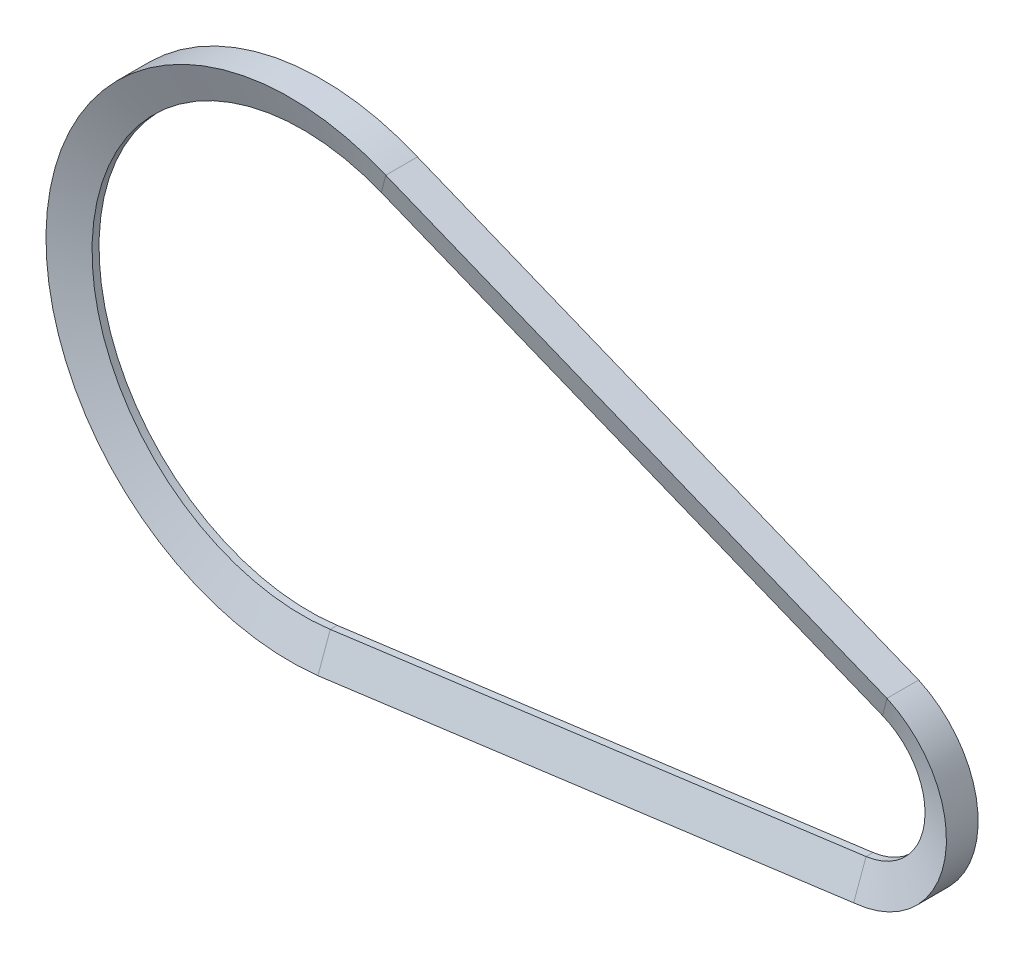
ISO-10303-21;
HEADER;
FILE_DESCRIPTION(('STEP AP214'),'2;1');
FILE_NAME('part.step','',(''),(''),'','','');
FILE_SCHEMA(('AUTOMOTIVE_DESIGN { 1 0 10303 214 1 1 1 1 }'));
ENDSEC;
DATA;
#1=APPLICATION_CONTEXT('core data for automotive mechanical design processes');
#2=APPLICATION_PROTOCOL_DEFINITION('international standard','automotive_design',2000,#1);
#3=PRODUCT_CONTEXT('',#1,'mechanical');
#4=PRODUCT('Part','Part','',(#3));
#5=PRODUCT_RELATED_PRODUCT_CATEGORY('part','',(#4));
#6=PRODUCT_DEFINITION_FORMATION('','',#4);
#7=PRODUCT_DEFINITION_CONTEXT('part definition',#1,'design');
#8=PRODUCT_DEFINITION('design','',#6,#7);
#9=PRODUCT_DEFINITION_SHAPE('','',#8);
#10=(LENGTH_UNIT() NAMED_UNIT(*) SI_UNIT(.MILLI.,.METRE.));
#11=(NAMED_UNIT(*) PLANE_ANGLE_UNIT() SI_UNIT($,.RADIAN.));
#12=(NAMED_UNIT(*) SI_UNIT($,.STERADIAN.) SOLID_ANGLE_UNIT());
#13=UNCERTAINTY_MEASURE_WITH_UNIT(LENGTH_MEASURE(1.E-05),#10,'distance_accuracy_value','');
#14=(GEOMETRIC_REPRESENTATION_CONTEXT(3) GLOBAL_UNCERTAINTY_ASSIGNED_CONTEXT((#13)) GLOBAL_UNIT_ASSIGNED_CONTEXT((#10,
#11,#12)) REPRESENTATION_CONTEXT('',''));
#15=CARTESIAN_POINT('',(0.,0.,0.));
#16=DIRECTION('',(0.,0.,1.));
#17=DIRECTION('',(1.,0.,0.));
#18=AXIS2_PLACEMENT_3D('',#15,#16,#17);
#19=CARTESIAN_POINT('',(124.475719306739,-30.3693151564213,0.770223243003508));
#20=DIRECTION('',(0.0453981297575215,-0.341667511459933,-0.93872377269743));
#21=DIRECTION('',(0.,0.93969262078591,-0.342020143325666));
#22=AXIS2_PLACEMENT_3D('',#19,#20,#21);
#23=PLANE('',#22);
#24=DIRECTION('',(0.,-0.939692620785909,0.342020143325666));
#25=VECTOR('',#24,1.);
#26=CARTESIAN_POINT('',(124.475719306739,-30.3693151564213,0.770223243003508));
#27=LINE('',#26,#25);
#28=CARTESIAN_POINT('',(124.475719306739,-30.3693151564213,0.770223243003508));
#29=VERTEX_POINT('',#28);
#30=CARTESIAN_POINT('',(124.475719306739,-37.8693151564213,3.5));
#31=VERTEX_POINT('',#30);
#32=EDGE_CURVE('E158',#29,#31,#27,.T.);
#33=ORIENTED_EDGE('',*,*,#32,.F.);
#34=DIRECTION('',(-0.991287677094754,-0.131714620449235,0.));
#35=VECTOR('',#34,1.);
#36=CARTESIAN_POINT('',(124.475719306739,-30.3693151564213,0.770223243003508));
#37=LINE('',#36,#35);
#38=CARTESIAN_POINT('',(6.12472985088943,-46.0948769849061,0.770223243003508));
#39=VERTEX_POINT('',#38);
#40=EDGE_CURVE('E157',#29,#39,#37,.T.);
#41=ORIENTED_EDGE('',*,*,#40,.T.);
#42=DIRECTION('',(0.,-0.939692620785909,0.342020143325666));
#43=VECTOR('',#42,1.);
#44=CARTESIAN_POINT('',(6.12472985088943,-46.0948769849061,0.770223243003508));
#45=LINE('',#44,#43);
#46=CARTESIAN_POINT('',(6.12472985088943,-53.5948769849061,3.5));
#47=VERTEX_POINT('',#46);
#48=EDGE_CURVE('E134',#39,#47,#45,.T.);
#49=ORIENTED_EDGE('',*,*,#48,.T.);
#50=DIRECTION('',(-0.991287677094754,-0.131714620449235,0.));
#51=VECTOR('',#50,1.);
#52=CARTESIAN_POINT('',(124.475719306739,-37.8693151564214,3.5));
#53=LINE('',#52,#51);
#54=EDGE_CURVE('E163',#31,#47,#53,.T.);
#55=ORIENTED_EDGE('',*,*,#54,.F.);
#56=EDGE_LOOP('',(#33,#41,#49,#55));
#57=FACE_BOUND('',#56,.T.);
#58=ADVANCED_FACE('F39',(#57),#23,.F.);
#59=CARTESIAN_POINT('',(6.12472985088943,-46.0948769849061,0.770223243003508));
#60=CARTESIAN_POINT('',(-26.763809279918,-50.4648510588701,0.770223243003508));
#61=CARTESIAN_POINT('',(-50.2969528979131,-27.0780207687135,0.770223243003508));
#62=CARTESIAN_POINT('',(-46.1321783681313,5.8371327731105,0.770223243003508));
#63=CARTESIAN_POINT('',(-41.9674038383495,38.7522863149345,0.770223243003508));
#64=CARTESIAN_POINT('',(-13.3508763277611,55.5405867888214,0.770223243003508));
#65=CARTESIAN_POINT('',(17.412721367423,43.1166688715686,0.770223243003508));
#66=CARTESIAN_POINT('',(6.12472985088943,-53.5948769849061,3.5));
#67=CARTESIAN_POINT('',(-32.1150339629088,-57.9648510588701,3.5));
#68=CARTESIAN_POINT('',(-58.9139401287493,-30.3388698408812,3.5));
#69=CARTESIAN_POINT('',(-53.3840209820254,7.75044892662746,3.5));
#70=CARTESIAN_POINT('',(-47.8541018353016,45.8397676941362,3.5));
#71=CARTESIAN_POINT('',(-14.3055621138431,64.7043295098772,3.5));
#72=CARTESIAN_POINT('',(21.1127393983367,49.6404612173529,3.5));
#73=(BOUNDED_SURFACE() B_SPLINE_SURFACE(1,3,((#59,#60,#61,#62,#63,#64,#65),(#66,#67,#68,#69,#70,
#71,#72)),.UNSPECIFIED.,.F.,.F.,.F.) B_SPLINE_SURFACE_WITH_KNOTS((2,2),(4,3,4),(0.,1.),(0.,0.5,
1.),.UNSPECIFIED.) GEOMETRIC_REPRESENTATION_ITEM() RATIONAL_B_SPLINE_SURFACE(((1.,
0.740188803038642,0.740188803038642,1.,0.740188803038642,0.740188803038642,1.),(1.,
0.740188803038642,0.740188803038642,1.,0.740188803038642,0.740188803038642,1.))) REPRESENTATION_ITEM('') SURFACE());
#74=CARTESIAN_POINT('',(0.,0.,3.5));
#75=DIRECTION('',(0.,0.,-1.));
#76=DIRECTION('',(0.113539290883504,-0.993533506946631,0.));
#77=AXIS2_PLACEMENT_3D('',#74,#75,#76);
#78=CIRCLE('',#77,53.94370356931);
#79=CARTESIAN_POINT('',(21.1127393983366,49.6404612173529,3.5));
#80=VERTEX_POINT('',#79);
#81=EDGE_CURVE('E124',#47,#80,#78,.T.);
#82=CARTESIAN_POINT('',(0.,0.,0.770223243003508));
#83=DIRECTION('',(0.,0.,-1.));
#84=DIRECTION('',(0.131714620449235,-0.991287677094754,0.));
#85=AXIS2_PLACEMENT_3D('',#82,#83,#84);
#86=CIRCLE('',#85,46.5);
#87=CARTESIAN_POINT('',(17.4127213674229,43.1166688715686,0.770223243003508));
#88=VERTEX_POINT('',#87);
#89=EDGE_CURVE('E137',#39,#88,#86,.T.);
#90=DIRECTION('',(0.463583952056587,0.817381270249745,0.342020143325666));
#91=VECTOR('',#90,1.);
#92=CARTESIAN_POINT('',(17.4127213674229,43.1166688715686,0.770223243003508));
#93=LINE('',#92,#91);
#94=EDGE_CURVE('E154',#88,#80,#93,.T.);
#95=ORIENTED_EDGE('',*,*,#81,.F.);
#96=ORIENTED_EDGE('',*,*,#48,.F.);
#97=ORIENTED_EDGE('',*,*,#89,.T.);
#98=ORIENTED_EDGE('',*,*,#94,.T.);
#99=EDGE_LOOP('',(#95,#96,#97,#98));
#100=FACE_BOUND('',#99,.T.);
#101=ADVANCED_FACE('F136',(#100),#73,.F.);
#102=CARTESIAN_POINT('',(0.,0.,0.));
#103=DIRECTION('',(0.,0.,-1.));
#104=DIRECTION('',(-1.,0.,0.));
#105=AXIS2_PLACEMENT_3D('',#102,#103,#104);
#106=CYLINDRICAL_SURFACE('',#105,53.94370356931);
#107=CARTESIAN_POINT('',(0.,0.,-3.5));
#108=DIRECTION('',(0.,0.,-1.));
#109=DIRECTION('',(0.113539290883504,-0.993533506946631,0.));
#110=AXIS2_PLACEMENT_3D('',#107,#108,#109);
#111=CIRCLE('',#110,53.94370356931);
#112=CARTESIAN_POINT('',(6.12472985088943,-53.5948769849061,-3.5));
#113=VERTEX_POINT('',#112);
#114=CARTESIAN_POINT('',(21.1127393983366,49.6404612173529,-3.5));
#115=VERTEX_POINT('',#114);
#116=EDGE_CURVE('E118',#113,#115,#111,.T.);
#117=ORIENTED_EDGE('',*,*,#116,.F.);
#118=DIRECTION('',(0.,0.,-1.));
#119=VECTOR('',#118,1.);
#120=CARTESIAN_POINT('',(6.12472985088943,-53.5948769849061,3.5));
#121=LINE('',#120,#119);
#122=EDGE_CURVE('E143',#47,#113,#121,.T.);
#123=ORIENTED_EDGE('',*,*,#122,.F.);
#124=ORIENTED_EDGE('',*,*,#81,.T.);
#125=DIRECTION('',(0.,0.,-1.));
#126=VECTOR('',#125,1.);
#127=CARTESIAN_POINT('',(21.1127393983366,49.6404612173529,3.5));
#128=LINE('',#127,#126);
#129=EDGE_CURVE('E210',#80,#115,#128,.T.);
#130=ORIENTED_EDGE('',*,*,#129,.T.);
#131=EDGE_LOOP('',(#117,#123,#124,#130));
#132=FACE_BOUND('',#131,.T.);
#133=ADVANCED_FACE('F250',(#132),#106,.T.);
#134=CARTESIAN_POINT('',(6.12472985088943,-53.5948769849061,-3.5));
#135=CARTESIAN_POINT('',(-32.1150339629088,-57.9648510588701,-3.5));
#136=CARTESIAN_POINT('',(-58.9139401287493,-30.3388698408812,-3.5));
#137=CARTESIAN_POINT('',(-53.3840209820254,7.75044892662746,-3.5));
#138=CARTESIAN_POINT('',(-47.8541018353016,45.8397676941362,-3.5));
#139=CARTESIAN_POINT('',(-14.3055621138431,64.7043295098772,-3.5));
#140=CARTESIAN_POINT('',(21.1127393983367,49.6404612173529,-3.5));
#141=CARTESIAN_POINT('',(6.12472985088943,-46.0948769849061,-0.770223243003508));
#142=CARTESIAN_POINT('',(-26.763809279918,-50.4648510588701,-0.770223243003508));
#143=CARTESIAN_POINT('',(-50.2969528979131,-27.0780207687135,-0.770223243003508));
#144=CARTESIAN_POINT('',(-46.1321783681313,5.8371327731105,-0.770223243003508));
#145=CARTESIAN_POINT('',(-41.9674038383495,38.7522863149345,-0.770223243003508));
#146=CARTESIAN_POINT('',(-13.3508763277611,55.5405867888214,-0.770223243003508));
#147=CARTESIAN_POINT('',(17.412721367423,43.1166688715686,-0.770223243003508));
#148=(BOUNDED_SURFACE() B_SPLINE_SURFACE(1,3,((#134,#135,#136,#137,#138,#139,#140),(#141,#142,
#143,#144,#145,#146,#147)),.UNSPECIFIED.,.F.,.F.,.F.) B_SPLINE_SURFACE_WITH_KNOTS((2,2),(4,3,4),
(0.,1.),(0.,0.5,1.),
.UNSPECIFIED.) GEOMETRIC_REPRESENTATION_ITEM() RATIONAL_B_SPLINE_SURFACE(((1.,0.740188803038642,
0.740188803038642,1.,0.740188803038642,0.740188803038642,1.),(1.,0.740188803038642,
0.740188803038642,1.,0.740188803038642,0.740188803038642,1.))) REPRESENTATION_ITEM('') SURFACE());
#149=CARTESIAN_POINT('',(0.,0.,-0.770223243003508));
#150=DIRECTION('',(0.,0.,-1.));
#151=DIRECTION('',(0.131714620449235,-0.991287677094754,0.));
#152=AXIS2_PLACEMENT_3D('',#149,#150,#151);
#153=CIRCLE('',#152,46.5);
#154=CARTESIAN_POINT('',(6.12472985088943,-46.0948769849061,-0.770223243003508));
#155=VERTEX_POINT('',#154);
#156=CARTESIAN_POINT('',(17.4127213674229,43.1166688715686,-0.770223243003508));
#157=VERTEX_POINT('',#156);
#158=EDGE_CURVE('E176',#155,#157,#153,.T.);
#159=DIRECTION('',(0.,0.939692620785909,0.342020143325666));
#160=VECTOR('',#159,1.);
#161=CARTESIAN_POINT('',(6.12472985088943,-53.5948769849061,-3.5));
#162=LINE('',#161,#160);
#163=EDGE_CURVE('E167',#113,#155,#162,.T.);
#164=DIRECTION('',(-0.463583952056587,-0.817381270249745,0.342020143325666));
#165=VECTOR('',#164,1.);
#166=CARTESIAN_POINT('',(21.1127393983366,49.6404612173529,-3.5));
#167=LINE('',#166,#165);
#168=EDGE_CURVE('E206',#115,#157,#167,.T.);
#169=ORIENTED_EDGE('',*,*,#158,.F.);
#170=ORIENTED_EDGE('',*,*,#163,.F.);
#171=ORIENTED_EDGE('',*,*,#116,.T.);
#172=ORIENTED_EDGE('',*,*,#168,.T.);
#173=EDGE_LOOP('',(#169,#170,#171,#172));
#174=FACE_BOUND('',#173,.T.);
#175=ADVANCED_FACE('F205',(#174),#148,.F.);
#176=CARTESIAN_POINT('',(0.,0.,0.));
#177=DIRECTION('',(0.,0.,-1.));
#178=DIRECTION('',(-1.,0.,0.));
#179=AXIS2_PLACEMENT_3D('',#176,#177,#178);
#180=CYLINDRICAL_SURFACE('',#179,46.5);
#181=DIRECTION('',(0.,0.,1.));
#182=VECTOR('',#181,1.);
#183=CARTESIAN_POINT('',(17.4127213674229,43.1166688715686,0.770223243003508));
#184=LINE('',#183,#182);
#185=EDGE_CURVE('E151',#157,#88,#184,.T.);
#186=ORIENTED_EDGE('',*,*,#185,.T.);
#187=ORIENTED_EDGE('',*,*,#89,.F.);
#188=DIRECTION('',(0.,0.,1.));
#189=VECTOR('',#188,1.);
#190=CARTESIAN_POINT('',(6.12472985088943,-46.0948769849061,0.770223243003508));
#191=LINE('',#190,#189);
#192=EDGE_CURVE('E150',#155,#39,#191,.T.);
#193=ORIENTED_EDGE('',*,*,#192,.F.);
#194=ORIENTED_EDGE('',*,*,#158,.T.);
#195=EDGE_LOOP('',(#186,#187,#193,#194));
#196=FACE_BOUND('',#195,.T.);
#197=ADVANCED_FACE('F148',(#196),#180,.F.);
#198=CARTESIAN_POINT('',(17.412721367423,43.1166688715686,0.770223243003508));
#199=DIRECTION('',(0.129067730873883,0.319592239298409,-0.93872377269743));
#200=DIRECTION('',(0.,0.946641691748174,0.322287926308379));
#201=AXIS2_PLACEMENT_3D('',#198,#199,#200);
#202=PLANE('',#201);
#203=DIRECTION('',(0.927240190786421,-0.374467126181139,0.));
#204=VECTOR('',#203,1.);
#205=CARTESIAN_POINT('',(21.1127393983367,49.6404612173529,3.5));
#206=LINE('',#205,#204);
#207=CARTESIAN_POINT('',(131.817024923631,4.93239520758056,3.5));
#208=VERTEX_POINT('',#207);
#209=EDGE_CURVE('E105',#80,#208,#206,.T.);
#210=ORIENTED_EDGE('',*,*,#209,.F.);
#211=ORIENTED_EDGE('',*,*,#94,.F.);
#212=DIRECTION('',(0.927240190786421,-0.374467126181139,0.));
#213=VECTOR('',#212,1.);
#214=CARTESIAN_POINT('',(17.412721367423,43.1166688715686,0.770223243003508));
#215=LINE('',#214,#213);
#216=CARTESIAN_POINT('',(128.117006892717,-1.59139713820371,0.770223243003508));
#217=VERTEX_POINT('',#216);
#218=EDGE_CURVE('E175',#88,#217,#215,.T.);
#219=ORIENTED_EDGE('',*,*,#218,.T.);
#220=DIRECTION('',(0.463583952056588,0.817381270249744,0.342020143325666));
#221=VECTOR('',#220,1.);
#222=CARTESIAN_POINT('',(128.117006892717,-1.5913971382037,0.770223243003508));
#223=LINE('',#222,#221);
#224=EDGE_CURVE('E188',#217,#208,#223,.T.);
#225=ORIENTED_EDGE('',*,*,#224,.T.);
#226=EDGE_LOOP('',(#210,#211,#219,#225));
#227=FACE_BOUND('',#226,.T.);
#228=ADVANCED_FACE('F246',(#227),#202,.F.);
#229=CARTESIAN_POINT('',(21.1127393983367,49.6404612173529,3.5));
#230=DIRECTION('',(-0.374467126181139,-0.927240190786421,0.));
#231=DIRECTION('',(0.927240190786421,-0.374467126181139,0.));
#232=AXIS2_PLACEMENT_3D('',#229,#230,#231);
#233=PLANE('',#232);
#234=DIRECTION('',(0.927240190786421,-0.374467126181139,0.));
#235=VECTOR('',#234,1.);
#236=CARTESIAN_POINT('',(21.1127393983367,49.6404612173529,-3.5));
#237=LINE('',#236,#235);
#238=CARTESIAN_POINT('',(131.817024923631,4.93239520758056,-3.5));
#239=VERTEX_POINT('',#238);
#240=EDGE_CURVE('E98',#115,#239,#237,.T.);
#241=ORIENTED_EDGE('',*,*,#240,.F.);
#242=ORIENTED_EDGE('',*,*,#129,.F.);
#243=ORIENTED_EDGE('',*,*,#209,.T.);
#244=DIRECTION('',(0.,0.,-1.));
#245=VECTOR('',#244,1.);
#246=CARTESIAN_POINT('',(131.817024923631,4.93239520758058,3.5));
#247=LINE('',#246,#245);
#248=EDGE_CURVE('E185',#208,#239,#247,.T.);
#249=ORIENTED_EDGE('',*,*,#248,.T.);
#250=EDGE_LOOP('',(#241,#242,#243,#249));
#251=FACE_BOUND('',#250,.T.);
#252=ADVANCED_FACE('F249',(#251),#233,.F.);
#253=CARTESIAN_POINT('',(21.1127393983367,49.6404612173529,-3.5));
#254=DIRECTION('',(0.129067730873883,0.319592239298409,0.938723772697429));
#255=DIRECTION('',(0.,-0.946641691748174,0.322287926308379));
#256=AXIS2_PLACEMENT_3D('',#253,#254,#255);
#257=PLANE('',#256);
#258=DIRECTION('',(0.927240190786421,-0.374467126181139,0.));
#259=VECTOR('',#258,1.);
#260=CARTESIAN_POINT('',(17.412721367423,43.1166688715686,-0.770223243003508));
#261=LINE('',#260,#259);
#262=CARTESIAN_POINT('',(128.117006892717,-1.59139713820371,-0.770223243003508));
#263=VERTEX_POINT('',#262);
#264=EDGE_CURVE('E89',#157,#263,#261,.T.);
#265=ORIENTED_EDGE('',*,*,#264,.F.);
#266=ORIENTED_EDGE('',*,*,#168,.F.);
#267=ORIENTED_EDGE('',*,*,#240,.T.);
#268=DIRECTION('',(-0.463583952056588,-0.817381270249744,0.342020143325666));
#269=VECTOR('',#268,1.);
#270=CARTESIAN_POINT('',(131.817024923631,4.93239520758058,-3.5));
#271=LINE('',#270,#269);
#272=EDGE_CURVE('E180',#239,#263,#271,.T.);
#273=ORIENTED_EDGE('',*,*,#272,.T.);
#274=EDGE_LOOP('',(#265,#266,#267,#273));
#275=FACE_BOUND('',#274,.T.);
#276=ADVANCED_FACE('F268',(#275),#257,.F.);
#277=CARTESIAN_POINT('',(17.412721367423,43.1166688715686,0.770223243003508));
#278=DIRECTION('',(0.374467126181139,0.927240190786421,0.));
#279=DIRECTION('',(-0.927240190786421,0.374467126181139,0.));
#280=AXIS2_PLACEMENT_3D('',#277,#278,#279);
#281=PLANE('',#280);
#282=DIRECTION('',(0.,0.,1.));
#283=VECTOR('',#282,1.);
#284=CARTESIAN_POINT('',(128.117006892717,-1.5913971382037,0.770223243003508));
#285=LINE('',#284,#283);
#286=EDGE_CURVE('E177',#263,#217,#285,.T.);
#287=ORIENTED_EDGE('',*,*,#286,.T.);
#288=ORIENTED_EDGE('',*,*,#218,.F.);
#289=ORIENTED_EDGE('',*,*,#185,.F.);
#290=ORIENTED_EDGE('',*,*,#264,.T.);
#291=EDGE_LOOP('',(#287,#288,#289,#290));
#292=FACE_BOUND('',#291,.T.);
#293=ADVANCED_FACE('F260',(#292),#281,.F.);
#294=CARTESIAN_POINT('',(128.117006892717,-1.59139713820367,0.770223243003508));
#295=CARTESIAN_POINT('',(145.926890042233,-8.78394101937953,0.770223243003508));
#296=CARTESIAN_POINT('',(143.51578882922,-27.8394183480289,0.770223243003508));
#297=CARTESIAN_POINT('',(124.475719306739,-30.3693151564213,0.770223243003508));
#298=CARTESIAN_POINT('',(131.817024923631,4.93239520758061,3.5));
#299=CARTESIAN_POINT('',(157.980585327767,-6.99799973142357,3.5));
#300=CARTESIAN_POINT('',(153.119494172499,-35.3394183480289,3.5));
#301=CARTESIAN_POINT('',(124.475719306738,-37.8693151564213,3.5));
#302=(BOUNDED_SURFACE() B_SPLINE_SURFACE(1,3,((#294,#295,#296,#297),(#298,#299,#300,#301)),
.UNSPECIFIED.,.F.,.F.,.F.) B_SPLINE_SURFACE_WITH_KNOTS((2,2),(4,4),(0.,1.),(0.,1.),
.UNSPECIFIED.) GEOMETRIC_REPRESENTATION_ITEM() RATIONAL_B_SPLINE_SURFACE(((1.,0.503405880312619,
0.503405880312619,1.),(1.,0.503405880312619,0.503405880312619,1.))) REPRESENTATION_ITEM('') SURFACE());
#303=CARTESIAN_POINT('',(122.5,-15.5,3.5));
#304=DIRECTION('',(0.,0.,-1.));
#305=DIRECTION('',(0.414894040337447,0.909869735342631,0.));
#306=AXIS2_PLACEMENT_3D('',#303,#304,#305);
#307=CIRCLE('',#306,22.4563961344273);
#308=EDGE_CURVE('E220',#208,#31,#307,.T.);
#309=CARTESIAN_POINT('',(122.5,-15.5,0.770223243003508));
#310=DIRECTION('',(0.,0.,-1.));
#311=DIRECTION('',(0.374467126181138,0.927240190786422,0.));
#312=AXIS2_PLACEMENT_3D('',#309,#310,#311);
#313=CIRCLE('',#312,15.);
#314=EDGE_CURVE('E179',#217,#29,#313,.T.);
#315=ORIENTED_EDGE('',*,*,#308,.F.);
#316=ORIENTED_EDGE('',*,*,#224,.F.);
#317=ORIENTED_EDGE('',*,*,#314,.T.);
#318=ORIENTED_EDGE('',*,*,#32,.T.);
#319=EDGE_LOOP('',(#315,#316,#317,#318));
#320=FACE_BOUND('',#319,.T.);
#321=ADVANCED_FACE('F258',(#320),#302,.F.);
#322=CARTESIAN_POINT('',(122.5,-15.5,0.));
#323=DIRECTION('',(0.,0.,-1.));
#324=DIRECTION('',(-1.,0.,0.));
#325=AXIS2_PLACEMENT_3D('',#322,#323,#324);
#326=CYLINDRICAL_SURFACE('',#325,22.4563961344273);
#327=CARTESIAN_POINT('',(122.5,-15.5,-3.5));
#328=DIRECTION('',(0.,0.,-1.));
#329=DIRECTION('',(0.414894040337447,0.909869735342631,0.));
#330=AXIS2_PLACEMENT_3D('',#327,#328,#329);
#331=CIRCLE('',#330,22.4563961344273);
#332=CARTESIAN_POINT('',(124.475719306739,-37.8693151564213,-3.5));
#333=VERTEX_POINT('',#332);
#334=EDGE_CURVE('E65',#239,#333,#331,.T.);
#335=ORIENTED_EDGE('',*,*,#334,.F.);
#336=ORIENTED_EDGE('',*,*,#248,.F.);
#337=ORIENTED_EDGE('',*,*,#308,.T.);
#338=DIRECTION('',(0.,0.,-1.));
#339=VECTOR('',#338,1.);
#340=CARTESIAN_POINT('',(124.475719306739,-37.8693151564213,3.5));
#341=LINE('',#340,#339);
#342=EDGE_CURVE('E217',#31,#333,#341,.T.);
#343=ORIENTED_EDGE('',*,*,#342,.T.);
#344=EDGE_LOOP('',(#335,#336,#337,#343));
#345=FACE_BOUND('',#344,.T.);
#346=ADVANCED_FACE('F255',(#345),#326,.T.);
#347=CARTESIAN_POINT('',(131.817024923631,4.93239520758061,-3.5));
#348=CARTESIAN_POINT('',(157.980585327767,-6.99799973142357,-3.5));
#349=CARTESIAN_POINT('',(153.119494172499,-35.3394183480289,-3.5));
#350=CARTESIAN_POINT('',(124.475719306738,-37.8693151564213,-3.5));
#351=CARTESIAN_POINT('',(128.117006892717,-1.59139713820367,-0.770223243003508));
#352=CARTESIAN_POINT('',(145.926890042233,-8.78394101937953,-0.770223243003508));
#353=CARTESIAN_POINT('',(143.51578882922,-27.8394183480289,-0.770223243003508));
#354=CARTESIAN_POINT('',(124.475719306739,-30.3693151564213,-0.770223243003508));
#355=(BOUNDED_SURFACE() B_SPLINE_SURFACE(1,3,((#347,#348,#349,#350),(#351,#352,#353,#354)),
.UNSPECIFIED.,.F.,.F.,.F.) B_SPLINE_SURFACE_WITH_KNOTS((2,2),(4,4),(0.,1.),(0.,1.),
.UNSPECIFIED.) GEOMETRIC_REPRESENTATION_ITEM() RATIONAL_B_SPLINE_SURFACE(((1.,0.503405880312619,
0.503405880312619,1.),(1.,0.503405880312619,0.503405880312619,1.))) REPRESENTATION_ITEM('') SURFACE());
#356=CARTESIAN_POINT('',(122.5,-15.5,-0.770223243003508));
#357=DIRECTION('',(0.,0.,-1.));
#358=DIRECTION('',(0.374467126181138,0.927240190786422,0.));
#359=AXIS2_PLACEMENT_3D('',#356,#357,#358);
#360=CIRCLE('',#359,15.);
#361=CARTESIAN_POINT('',(124.475719306739,-30.3693151564213,-0.770223243003508));
#362=VERTEX_POINT('',#361);
#363=EDGE_CURVE('E57',#263,#362,#360,.T.);
#364=DIRECTION('',(0.,0.939692620785909,0.342020143325666));
#365=VECTOR('',#364,1.);
#366=CARTESIAN_POINT('',(124.475719306739,-37.8693151564213,-3.5));
#367=LINE('',#366,#365);
#368=EDGE_CURVE('E195',#333,#362,#367,.T.);
#369=ORIENTED_EDGE('',*,*,#363,.F.);
#370=ORIENTED_EDGE('',*,*,#272,.F.);
#371=ORIENTED_EDGE('',*,*,#334,.T.);
#372=ORIENTED_EDGE('',*,*,#368,.T.);
#373=EDGE_LOOP('',(#369,#370,#371,#372));
#374=FACE_BOUND('',#373,.T.);
#375=ADVANCED_FACE('F266',(#374),#355,.F.);
#376=CARTESIAN_POINT('',(122.5,-15.5,0.));
#377=DIRECTION('',(0.,0.,-1.));
#378=DIRECTION('',(-1.,0.,0.));
#379=AXIS2_PLACEMENT_3D('',#376,#377,#378);
#380=CYLINDRICAL_SURFACE('',#379,15.);
#381=DIRECTION('',(0.,0.,1.));
#382=VECTOR('',#381,1.);
#383=CARTESIAN_POINT('',(124.475719306739,-30.3693151564213,0.770223243003508));
#384=LINE('',#383,#382);
#385=EDGE_CURVE('E43',#362,#29,#384,.T.);
#386=ORIENTED_EDGE('',*,*,#385,.T.);
#387=ORIENTED_EDGE('',*,*,#314,.F.);
#388=ORIENTED_EDGE('',*,*,#286,.F.);
#389=ORIENTED_EDGE('',*,*,#363,.T.);
#390=EDGE_LOOP('',(#386,#387,#388,#389));
#391=FACE_BOUND('',#390,.T.);
#392=ADVANCED_FACE('F199',(#391),#380,.F.);
#393=CARTESIAN_POINT('',(124.475719306739,-37.8693151564214,3.5));
#394=DIRECTION('',(-0.131714620449235,0.991287677094754,0.));
#395=DIRECTION('',(-0.991287677094755,-0.131714620449235,0.));
#396=AXIS2_PLACEMENT_3D('',#393,#394,#395);
#397=PLANE('',#396);
#398=ORIENTED_EDGE('',*,*,#54,.T.);
#399=ORIENTED_EDGE('',*,*,#122,.T.);
#400=DIRECTION('',(-0.991287677094754,-0.131714620449235,0.));
#401=VECTOR('',#400,1.);
#402=CARTESIAN_POINT('',(124.475719306739,-37.8693151564214,-3.5));
#403=LINE('',#402,#401);
#404=EDGE_CURVE('E49',#333,#113,#403,.T.);
#405=ORIENTED_EDGE('',*,*,#404,.F.);
#406=ORIENTED_EDGE('',*,*,#342,.F.);
#407=EDGE_LOOP('',(#398,#399,#405,#406));
#408=FACE_BOUND('',#407,.T.);
#409=ADVANCED_FACE('F252',(#408),#397,.F.);
#410=CARTESIAN_POINT('',(124.475719306739,-37.8693151564214,-3.5));
#411=DIRECTION('',(0.0453981297575216,-0.341667511459934,0.938723772697429));
#412=DIRECTION('',(0.,-0.93969262078591,-0.342020143325666));
#413=AXIS2_PLACEMENT_3D('',#410,#411,#412);
#414=PLANE('',#413);
#415=ORIENTED_EDGE('',*,*,#404,.T.);
#416=ORIENTED_EDGE('',*,*,#163,.T.);
#417=DIRECTION('',(-0.991287677094754,-0.131714620449235,0.));
#418=VECTOR('',#417,1.);
#419=CARTESIAN_POINT('',(124.475719306739,-30.3693151564213,-0.770223243003508));
#420=LINE('',#419,#418);
#421=EDGE_CURVE('E11',#362,#155,#420,.T.);
#422=ORIENTED_EDGE('',*,*,#421,.F.);
#423=ORIENTED_EDGE('',*,*,#368,.F.);
#424=EDGE_LOOP('',(#415,#416,#422,#423));
#425=FACE_BOUND('',#424,.T.);
#426=ADVANCED_FACE('F203',(#425),#414,.F.);
#427=CARTESIAN_POINT('',(124.475719306739,-30.3693151564213,0.770223243003508));
#428=DIRECTION('',(0.131714620449235,-0.991287677094754,0.));
#429=DIRECTION('',(0.991287677094755,0.131714620449235,0.));
#430=AXIS2_PLACEMENT_3D('',#427,#428,#429);
#431=PLANE('',#430);
#432=ORIENTED_EDGE('',*,*,#421,.T.);
#433=ORIENTED_EDGE('',*,*,#192,.T.);
#434=ORIENTED_EDGE('',*,*,#40,.F.);
#435=ORIENTED_EDGE('',*,*,#385,.F.);
#436=EDGE_LOOP('',(#432,#433,#434,#435));
#437=FACE_BOUND('',#436,.T.);
#438=ADVANCED_FACE('F41',(#437),#431,.F.);
#439=CLOSED_SHELL('',(#58,#101,#133,#175,#197,#228,#252,#276,#293,#321,#346,#375,#392,#409,#426,#438));
#440=MANIFOLD_SOLID_BREP('B2',#439);
#441=ADVANCED_BREP_SHAPE_REPRESENTATION('',(#18,#440),#14);
#442=SHAPE_DEFINITION_REPRESENTATION(#9,#441);
ENDSEC;
END-ISO-10303-21;
